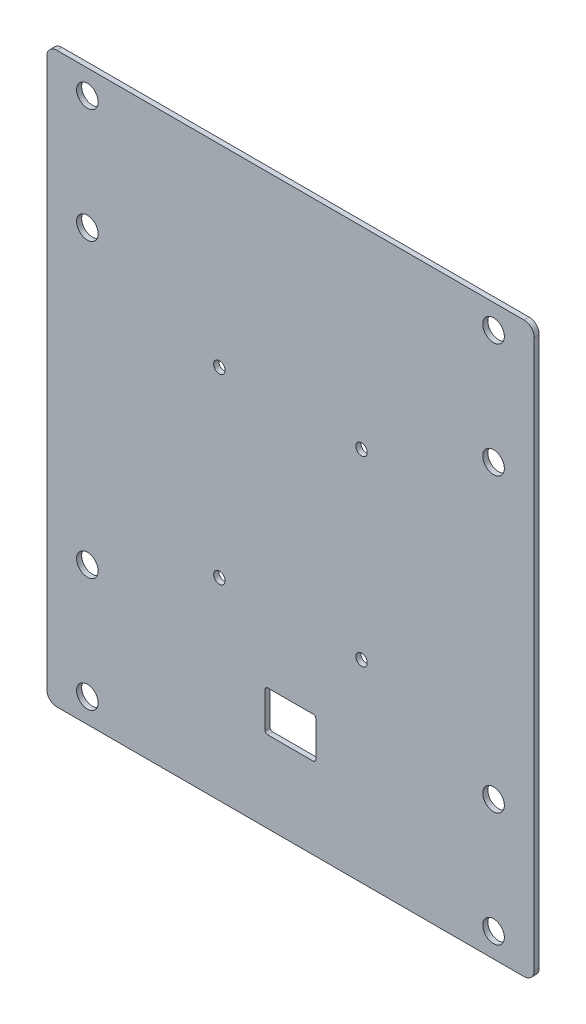
ISO-10303-21;
HEADER;
FILE_DESCRIPTION(('STEP AP214'),'2;1');
FILE_NAME('part.step','',(''),(''),'','','');
FILE_SCHEMA(('AUTOMOTIVE_DESIGN { 1 0 10303 214 1 1 1 1 }'));
ENDSEC;
DATA;
#1=APPLICATION_CONTEXT('core data for automotive mechanical design processes');
#2=APPLICATION_PROTOCOL_DEFINITION('international standard','automotive_design',2000,#1);
#3=PRODUCT_CONTEXT('',#1,'mechanical');
#4=PRODUCT('Part','Part','',(#3));
#5=PRODUCT_RELATED_PRODUCT_CATEGORY('part','',(#4));
#6=PRODUCT_DEFINITION_FORMATION('','',#4);
#7=PRODUCT_DEFINITION_CONTEXT('part definition',#1,'design');
#8=PRODUCT_DEFINITION('design','',#6,#7);
#9=PRODUCT_DEFINITION_SHAPE('','',#8);
#10=(LENGTH_UNIT() NAMED_UNIT(*) SI_UNIT(.MILLI.,.METRE.));
#11=(NAMED_UNIT(*) PLANE_ANGLE_UNIT() SI_UNIT($,.RADIAN.));
#12=(NAMED_UNIT(*) SI_UNIT($,.STERADIAN.) SOLID_ANGLE_UNIT());
#13=UNCERTAINTY_MEASURE_WITH_UNIT(LENGTH_MEASURE(1.E-05),#10,'distance_accuracy_value','');
#14=(GEOMETRIC_REPRESENTATION_CONTEXT(3) GLOBAL_UNCERTAINTY_ASSIGNED_CONTEXT((#13)) GLOBAL_UNIT_ASSIGNED_CONTEXT((#10,
#11,#12)) REPRESENTATION_CONTEXT('',''));
#15=CARTESIAN_POINT('',(0.,0.,0.));
#16=DIRECTION('',(0.,0.,1.));
#17=DIRECTION('',(1.,0.,0.));
#18=AXIS2_PLACEMENT_3D('',#15,#16,#17);
#19=CARTESIAN_POINT('',(152.4,177.8,3.175));
#20=DIRECTION('',(-1.,0.,0.));
#21=DIRECTION('',(0.,-1.,0.));
#22=AXIS2_PLACEMENT_3D('',#19,#20,#21);
#23=PLANE('',#22);
#24=DIRECTION('',(0.,1.,0.));
#25=VECTOR('',#24,1.);
#26=CARTESIAN_POINT('',(152.4,177.8,3.175));
#27=LINE('',#26,#25);
#28=CARTESIAN_POINT('',(152.4,-171.45,3.175));
#29=VERTEX_POINT('',#28);
#30=CARTESIAN_POINT('',(152.4,171.45,3.175));
#31=VERTEX_POINT('',#30);
#32=EDGE_CURVE('E164',#29,#31,#27,.T.);
#33=ORIENTED_EDGE('',*,*,#32,.F.);
#34=DIRECTION('',(0.,0.,-1.));
#35=VECTOR('',#34,1.);
#36=CARTESIAN_POINT('',(152.4,-171.45,3.175));
#37=LINE('',#36,#35);
#38=CARTESIAN_POINT('',(152.4,-171.45,0.));
#39=VERTEX_POINT('',#38);
#40=EDGE_CURVE('E149',#29,#39,#37,.T.);
#41=ORIENTED_EDGE('',*,*,#40,.T.);
#42=DIRECTION('',(0.,1.,0.));
#43=VECTOR('',#42,1.);
#44=CARTESIAN_POINT('',(152.4,177.8,0.));
#45=LINE('',#44,#43);
#46=CARTESIAN_POINT('',(152.4,171.45,0.));
#47=VERTEX_POINT('',#46);
#48=EDGE_CURVE('E161',#39,#47,#45,.T.);
#49=ORIENTED_EDGE('',*,*,#48,.T.);
#50=DIRECTION('',(0.,0.,-1.));
#51=VECTOR('',#50,1.);
#52=CARTESIAN_POINT('',(152.4,171.45,3.175));
#53=LINE('',#52,#51);
#54=EDGE_CURVE('E166',#47,#31,#53,.F.);
#55=ORIENTED_EDGE('',*,*,#54,.T.);
#56=EDGE_LOOP('',(#33,#41,#49,#55));
#57=FACE_BOUND('',#56,.T.);
#58=ADVANCED_FACE('F32',(#57),#23,.F.);
#59=CARTESIAN_POINT('',(-152.4,177.8,3.175));
#60=DIRECTION('',(0.,-1.,0.));
#61=DIRECTION('',(0.,0.,-1.));
#62=AXIS2_PLACEMENT_3D('',#59,#60,#61);
#63=PLANE('',#62);
#64=DIRECTION('',(-1.,0.,0.));
#65=VECTOR('',#64,1.);
#66=CARTESIAN_POINT('',(-152.4,177.8,3.175));
#67=LINE('',#66,#65);
#68=CARTESIAN_POINT('',(146.05,177.8,3.175));
#69=VERTEX_POINT('',#68);
#70=CARTESIAN_POINT('',(-146.05,177.8,3.175));
#71=VERTEX_POINT('',#70);
#72=EDGE_CURVE('E348',#69,#71,#67,.T.);
#73=ORIENTED_EDGE('',*,*,#72,.F.);
#74=DIRECTION('',(0.,0.,-1.));
#75=VECTOR('',#74,1.);
#76=CARTESIAN_POINT('',(146.05,177.8,3.175));
#77=LINE('',#76,#75);
#78=CARTESIAN_POINT('',(146.05,177.8,0.));
#79=VERTEX_POINT('',#78);
#80=EDGE_CURVE('E210',#69,#79,#77,.T.);
#81=ORIENTED_EDGE('',*,*,#80,.T.);
#82=DIRECTION('',(-1.,0.,0.));
#83=VECTOR('',#82,1.);
#84=CARTESIAN_POINT('',(-152.4,177.8,0.));
#85=LINE('',#84,#83);
#86=CARTESIAN_POINT('',(-146.05,177.8,0.));
#87=VERTEX_POINT('',#86);
#88=EDGE_CURVE('E171',#79,#87,#85,.T.);
#89=ORIENTED_EDGE('',*,*,#88,.T.);
#90=DIRECTION('',(0.,0.,-1.));
#91=VECTOR('',#90,1.);
#92=CARTESIAN_POINT('',(-146.05,177.8,3.175));
#93=LINE('',#92,#91);
#94=EDGE_CURVE('E208',#87,#71,#93,.F.);
#95=ORIENTED_EDGE('',*,*,#94,.T.);
#96=EDGE_LOOP('',(#73,#81,#89,#95));
#97=FACE_BOUND('',#96,.T.);
#98=ADVANCED_FACE('F373',(#97),#63,.F.);
#99=CARTESIAN_POINT('',(-152.4,177.8,3.175));
#100=DIRECTION('',(1.,0.,0.));
#101=DIRECTION('',(0.,1.,0.));
#102=AXIS2_PLACEMENT_3D('',#99,#100,#101);
#103=PLANE('',#102);
#104=DIRECTION('',(0.,-1.,0.));
#105=VECTOR('',#104,1.);
#106=CARTESIAN_POINT('',(-152.4,177.8,0.));
#107=LINE('',#106,#105);
#108=CARTESIAN_POINT('',(-152.4,171.45,0.));
#109=VERTEX_POINT('',#108);
#110=CARTESIAN_POINT('',(-152.4,-171.45,0.));
#111=VERTEX_POINT('',#110);
#112=EDGE_CURVE('E175',#109,#111,#107,.T.);
#113=ORIENTED_EDGE('',*,*,#112,.T.);
#114=DIRECTION('',(0.,0.,-1.));
#115=VECTOR('',#114,1.);
#116=CARTESIAN_POINT('',(-152.4,-171.45,3.175));
#117=LINE('',#116,#115);
#118=CARTESIAN_POINT('',(-152.4,-171.45,3.175));
#119=VERTEX_POINT('',#118);
#120=EDGE_CURVE('E206',#111,#119,#117,.F.);
#121=ORIENTED_EDGE('',*,*,#120,.T.);
#122=DIRECTION('',(0.,-1.,0.));
#123=VECTOR('',#122,1.);
#124=CARTESIAN_POINT('',(-152.4,177.8,3.175));
#125=LINE('',#124,#123);
#126=CARTESIAN_POINT('',(-152.4,171.45,3.175));
#127=VERTEX_POINT('',#126);
#128=EDGE_CURVE('E350',#127,#119,#125,.T.);
#129=ORIENTED_EDGE('',*,*,#128,.F.);
#130=DIRECTION('',(0.,0.,-1.));
#131=VECTOR('',#130,1.);
#132=CARTESIAN_POINT('',(-152.4,171.45,3.175));
#133=LINE('',#132,#131);
#134=EDGE_CURVE('E203',#127,#109,#133,.T.);
#135=ORIENTED_EDGE('',*,*,#134,.T.);
#136=EDGE_LOOP('',(#113,#121,#129,#135));
#137=FACE_BOUND('',#136,.T.);
#138=ADVANCED_FACE('F365',(#137),#103,.F.);
#139=CARTESIAN_POINT('',(-152.4,-177.8,3.175));
#140=DIRECTION('',(0.,1.,0.));
#141=DIRECTION('',(0.,0.,1.));
#142=AXIS2_PLACEMENT_3D('',#139,#140,#141);
#143=PLANE('',#142);
#144=DIRECTION('',(1.,0.,0.));
#145=VECTOR('',#144,1.);
#146=CARTESIAN_POINT('',(-152.4,-177.8,0.));
#147=LINE('',#146,#145);
#148=CARTESIAN_POINT('',(-146.05,-177.8,0.));
#149=VERTEX_POINT('',#148);
#150=CARTESIAN_POINT('',(146.05,-177.8,0.));
#151=VERTEX_POINT('',#150);
#152=EDGE_CURVE('E186',#149,#151,#147,.T.);
#153=ORIENTED_EDGE('',*,*,#152,.T.);
#154=DIRECTION('',(0.,0.,-1.));
#155=VECTOR('',#154,1.);
#156=CARTESIAN_POINT('',(146.05,-177.8,3.175));
#157=LINE('',#156,#155);
#158=CARTESIAN_POINT('',(146.05,-177.8,3.175));
#159=VERTEX_POINT('',#158);
#160=EDGE_CURVE('E150',#151,#159,#157,.F.);
#161=ORIENTED_EDGE('',*,*,#160,.T.);
#162=DIRECTION('',(1.,0.,0.));
#163=VECTOR('',#162,1.);
#164=CARTESIAN_POINT('',(-152.4,-177.8,3.175));
#165=LINE('',#164,#163);
#166=CARTESIAN_POINT('',(-146.05,-177.8,3.175));
#167=VERTEX_POINT('',#166);
#168=EDGE_CURVE('E181',#167,#159,#165,.T.);
#169=ORIENTED_EDGE('',*,*,#168,.F.);
#170=DIRECTION('',(0.,0.,-1.));
#171=VECTOR('',#170,1.);
#172=CARTESIAN_POINT('',(-146.05,-177.8,3.175));
#173=LINE('',#172,#171);
#174=EDGE_CURVE('E155',#167,#149,#173,.T.);
#175=ORIENTED_EDGE('',*,*,#174,.T.);
#176=EDGE_LOOP('',(#153,#161,#169,#175));
#177=FACE_BOUND('',#176,.T.);
#178=ADVANCED_FACE('F359',(#177),#143,.F.);
#179=CARTESIAN_POINT('',(0.,0.,3.175));
#180=DIRECTION('',(0.,0.,1.));
#181=DIRECTION('',(1.,0.,0.));
#182=AXIS2_PLACEMENT_3D('',#179,#180,#181);
#183=PLANE('',#182);
#184=DIRECTION('',(-1.,0.,0.));
#185=VECTOR('',#184,1.);
#186=CARTESIAN_POINT('',(0.,-101.6,3.175));
#187=LINE('',#186,#185);
#188=CARTESIAN_POINT('',(14.2875,-101.6,3.175));
#189=VERTEX_POINT('',#188);
#190=CARTESIAN_POINT('',(-14.2875,-101.6,3.175));
#191=VERTEX_POINT('',#190);
#192=EDGE_CURVE('E250',#189,#191,#187,.T.);
#193=ORIENTED_EDGE('',*,*,#192,.F.);
#194=CARTESIAN_POINT('',(14.2875,-103.1875,3.175));
#195=DIRECTION('',(0.,0.,1.));
#196=DIRECTION('',(1.,0.,0.));
#197=AXIS2_PLACEMENT_3D('',#194,#195,#196);
#198=CIRCLE('',#197,1.5875);
#199=CARTESIAN_POINT('',(15.875,-103.1875,3.175));
#200=VERTEX_POINT('',#199);
#201=EDGE_CURVE('E40',#189,#200,#198,.F.);
#202=ORIENTED_EDGE('',*,*,#201,.T.);
#203=DIRECTION('',(0.,-1.,0.));
#204=VECTOR('',#203,1.);
#205=CARTESIAN_POINT('',(15.8750000000001,0.,3.175));
#206=LINE('',#205,#204);
#207=CARTESIAN_POINT('',(15.875,-125.4125,3.175));
#208=VERTEX_POINT('',#207);
#209=EDGE_CURVE('E249',#200,#208,#206,.T.);
#210=ORIENTED_EDGE('',*,*,#209,.T.);
#211=CARTESIAN_POINT('',(14.2875,-125.4125,3.175));
#212=DIRECTION('',(0.,0.,1.));
#213=DIRECTION('',(1.,0.,0.));
#214=AXIS2_PLACEMENT_3D('',#211,#212,#213);
#215=CIRCLE('',#214,1.5875);
#216=CARTESIAN_POINT('',(14.2875,-127.,3.175));
#217=VERTEX_POINT('',#216);
#218=EDGE_CURVE('E232',#208,#217,#215,.F.);
#219=ORIENTED_EDGE('',*,*,#218,.T.);
#220=DIRECTION('',(-1.,0.,0.));
#221=VECTOR('',#220,1.);
#222=CARTESIAN_POINT('',(0.,-127.,3.175));
#223=LINE('',#222,#221);
#224=CARTESIAN_POINT('',(-14.2875,-127.,3.175));
#225=VERTEX_POINT('',#224);
#226=EDGE_CURVE('E259',#217,#225,#223,.T.);
#227=ORIENTED_EDGE('',*,*,#226,.T.);
#228=CARTESIAN_POINT('',(-14.2875,-125.4125,3.175));
#229=DIRECTION('',(0.,0.,1.));
#230=DIRECTION('',(1.,0.,0.));
#231=AXIS2_PLACEMENT_3D('',#228,#229,#230);
#232=CIRCLE('',#231,1.5875);
#233=CARTESIAN_POINT('',(-15.875,-125.4125,3.175));
#234=VERTEX_POINT('',#233);
#235=EDGE_CURVE('E236',#225,#234,#232,.F.);
#236=ORIENTED_EDGE('',*,*,#235,.T.);
#237=DIRECTION('',(0.,-1.,0.));
#238=VECTOR('',#237,1.);
#239=CARTESIAN_POINT('',(-15.875,0.,3.175));
#240=LINE('',#239,#238);
#241=CARTESIAN_POINT('',(-15.875,-103.1875,3.175));
#242=VERTEX_POINT('',#241);
#243=EDGE_CURVE('E275',#242,#234,#240,.T.);
#244=ORIENTED_EDGE('',*,*,#243,.F.);
#245=CARTESIAN_POINT('',(-14.2875,-103.1875,3.175));
#246=DIRECTION('',(0.,0.,1.));
#247=DIRECTION('',(1.,0.,0.));
#248=AXIS2_PLACEMENT_3D('',#245,#246,#247);
#249=CIRCLE('',#248,1.5875);
#250=EDGE_CURVE('E240',#242,#191,#249,.F.);
#251=ORIENTED_EDGE('',*,*,#250,.T.);
#252=EDGE_LOOP('',(#193,#202,#210,#219,#227,#236,#244,#251));
#253=FACE_BOUND('',#252,.T.);
#254=CARTESIAN_POINT('',(44.4499999999999,56.9515624999999,3.175));
#255=DIRECTION('',(0.,0.,-1.));
#256=DIRECTION('',(-1.,0.,0.));
#257=AXIS2_PLACEMENT_3D('',#254,#255,#256);
#258=CIRCLE('',#257,3.57124);
#259=CARTESIAN_POINT('',(40.8787599999999,56.9515624999999,3.175));
#260=VERTEX_POINT('',#259);
#261=EDGE_CURVE('E282',#260,#260,#258,.T.);
#262=ORIENTED_EDGE('',*,*,#261,.T.);
#263=EDGE_LOOP('',(#262));
#264=FACE_BOUND('',#263,.T.);
#265=CARTESIAN_POINT('',(44.4499999999999,-56.9515624999999,3.175));
#266=DIRECTION('',(0.,0.,-1.));
#267=DIRECTION('',(-1.,0.,0.));
#268=AXIS2_PLACEMENT_3D('',#265,#266,#267);
#269=CIRCLE('',#268,3.57124);
#270=CARTESIAN_POINT('',(40.8787599999999,-56.9515624999999,3.175));
#271=VERTEX_POINT('',#270);
#272=EDGE_CURVE('E288',#271,#271,#269,.T.);
#273=ORIENTED_EDGE('',*,*,#272,.T.);
#274=EDGE_LOOP('',(#273));
#275=FACE_BOUND('',#274,.T.);
#276=CARTESIAN_POINT('',(-44.4500000000001,56.9515624999999,3.175));
#277=DIRECTION('',(0.,0.,-1.));
#278=DIRECTION('',(-1.,0.,0.));
#279=AXIS2_PLACEMENT_3D('',#276,#277,#278);
#280=CIRCLE('',#279,3.57124);
#281=CARTESIAN_POINT('',(-48.0212400000001,56.9515624999999,3.175));
#282=VERTEX_POINT('',#281);
#283=EDGE_CURVE('E294',#282,#282,#280,.T.);
#284=ORIENTED_EDGE('',*,*,#283,.T.);
#285=EDGE_LOOP('',(#284));
#286=FACE_BOUND('',#285,.T.);
#287=CARTESIAN_POINT('',(-44.4500000000001,-56.9515624999999,3.175));
#288=DIRECTION('',(0.,0.,-1.));
#289=DIRECTION('',(-1.,0.,0.));
#290=AXIS2_PLACEMENT_3D('',#287,#288,#289);
#291=CIRCLE('',#290,3.57124);
#292=CARTESIAN_POINT('',(-48.0212400000001,-56.9515624999999,3.175));
#293=VERTEX_POINT('',#292);
#294=EDGE_CURVE('E300',#293,#293,#291,.T.);
#295=ORIENTED_EDGE('',*,*,#294,.T.);
#296=EDGE_LOOP('',(#295));
#297=FACE_BOUND('',#296,.T.);
#298=CARTESIAN_POINT('',(-127.,162.71875,3.175));
#299=DIRECTION('',(0.,0.,1.));
#300=DIRECTION('',(1.,0.,0.));
#301=AXIS2_PLACEMENT_3D('',#298,#299,#300);
#302=CIRCLE('',#301,6.746875);
#303=CARTESIAN_POINT('',(-120.253125,162.71875,3.175));
#304=VERTEX_POINT('',#303);
#305=EDGE_CURVE('E303',#304,#304,#302,.T.);
#306=ORIENTED_EDGE('',*,*,#305,.F.);
#307=EDGE_LOOP('',(#306));
#308=FACE_BOUND('',#307,.T.);
#309=CARTESIAN_POINT('',(-127.,91.2812499999997,3.175));
#310=DIRECTION('',(0.,0.,1.));
#311=DIRECTION('',(1.,0.,0.));
#312=AXIS2_PLACEMENT_3D('',#309,#310,#311);
#313=CIRCLE('',#312,6.746875);
#314=CARTESIAN_POINT('',(-120.253125,91.2812499999997,3.175));
#315=VERTEX_POINT('',#314);
#316=EDGE_CURVE('E309',#315,#315,#313,.T.);
#317=ORIENTED_EDGE('',*,*,#316,.F.);
#318=EDGE_LOOP('',(#317));
#319=FACE_BOUND('',#318,.T.);
#320=CARTESIAN_POINT('',(-127.,-91.2812500000001,3.175));
#321=DIRECTION('',(0.,0.,1.));
#322=DIRECTION('',(1.,0.,0.));
#323=AXIS2_PLACEMENT_3D('',#320,#321,#322);
#324=CIRCLE('',#323,6.746875);
#325=CARTESIAN_POINT('',(-120.253125,-91.2812500000001,3.175));
#326=VERTEX_POINT('',#325);
#327=EDGE_CURVE('E315',#326,#326,#324,.T.);
#328=ORIENTED_EDGE('',*,*,#327,.F.);
#329=EDGE_LOOP('',(#328));
#330=FACE_BOUND('',#329,.T.);
#331=CARTESIAN_POINT('',(-127.,-162.71875,3.175));
#332=DIRECTION('',(0.,0.,1.));
#333=DIRECTION('',(1.,0.,0.));
#334=AXIS2_PLACEMENT_3D('',#331,#332,#333);
#335=CIRCLE('',#334,6.746875);
#336=CARTESIAN_POINT('',(-120.253125,-162.71875,3.175));
#337=VERTEX_POINT('',#336);
#338=EDGE_CURVE('E321',#337,#337,#335,.T.);
#339=ORIENTED_EDGE('',*,*,#338,.F.);
#340=EDGE_LOOP('',(#339));
#341=FACE_BOUND('',#340,.T.);
#342=CARTESIAN_POINT('',(127.,-162.71875,3.175));
#343=DIRECTION('',(0.,0.,1.));
#344=DIRECTION('',(1.,0.,0.));
#345=AXIS2_PLACEMENT_3D('',#342,#343,#344);
#346=CIRCLE('',#345,6.74687500000001);
#347=CARTESIAN_POINT('',(133.746875,-162.71875,3.175));
#348=VERTEX_POINT('',#347);
#349=EDGE_CURVE('E327',#348,#348,#346,.T.);
#350=ORIENTED_EDGE('',*,*,#349,.F.);
#351=EDGE_LOOP('',(#350));
#352=FACE_BOUND('',#351,.T.);
#353=CARTESIAN_POINT('',(127.,-91.28125,3.175));
#354=DIRECTION('',(0.,0.,1.));
#355=DIRECTION('',(1.,0.,0.));
#356=AXIS2_PLACEMENT_3D('',#353,#354,#355);
#357=CIRCLE('',#356,6.74687499999999);
#358=CARTESIAN_POINT('',(133.746875,-91.28125,3.175));
#359=VERTEX_POINT('',#358);
#360=EDGE_CURVE('E333',#359,#359,#357,.T.);
#361=ORIENTED_EDGE('',*,*,#360,.F.);
#362=EDGE_LOOP('',(#361));
#363=FACE_BOUND('',#362,.T.);
#364=CARTESIAN_POINT('',(127.,91.2812499999998,3.175));
#365=DIRECTION('',(0.,0.,1.));
#366=DIRECTION('',(1.,0.,0.));
#367=AXIS2_PLACEMENT_3D('',#364,#365,#366);
#368=CIRCLE('',#367,6.74687499999999);
#369=CARTESIAN_POINT('',(133.746875,91.2812499999998,3.175));
#370=VERTEX_POINT('',#369);
#371=EDGE_CURVE('E339',#370,#370,#368,.T.);
#372=ORIENTED_EDGE('',*,*,#371,.F.);
#373=EDGE_LOOP('',(#372));
#374=FACE_BOUND('',#373,.T.);
#375=CARTESIAN_POINT('',(127.,162.71875,3.175));
#376=DIRECTION('',(0.,0.,1.));
#377=DIRECTION('',(1.,0.,0.));
#378=AXIS2_PLACEMENT_3D('',#375,#376,#377);
#379=CIRCLE('',#378,6.74687499999999);
#380=CARTESIAN_POINT('',(133.746875,162.71875,3.175));
#381=VERTEX_POINT('',#380);
#382=EDGE_CURVE('E178',#381,#381,#379,.T.);
#383=ORIENTED_EDGE('',*,*,#382,.F.);
#384=EDGE_LOOP('',(#383));
#385=FACE_BOUND('',#384,.T.);
#386=ORIENTED_EDGE('',*,*,#168,.T.);
#387=CARTESIAN_POINT('',(146.05,-171.45,3.175));
#388=DIRECTION('',(0.,0.,1.));
#389=DIRECTION('',(1.,0.,0.));
#390=AXIS2_PLACEMENT_3D('',#387,#388,#389);
#391=CIRCLE('',#390,6.35);
#392=EDGE_CURVE('E201',#159,#29,#391,.T.);
#393=ORIENTED_EDGE('',*,*,#392,.T.);
#394=ORIENTED_EDGE('',*,*,#32,.T.);
#395=CARTESIAN_POINT('',(146.05,171.45,3.175));
#396=DIRECTION('',(0.,0.,1.));
#397=DIRECTION('',(1.,0.,0.));
#398=AXIS2_PLACEMENT_3D('',#395,#396,#397);
#399=CIRCLE('',#398,6.35);
#400=EDGE_CURVE('E197',#31,#69,#399,.T.);
#401=ORIENTED_EDGE('',*,*,#400,.T.);
#402=ORIENTED_EDGE('',*,*,#72,.T.);
#403=CARTESIAN_POINT('',(-146.05,171.45,3.175));
#404=DIRECTION('',(0.,0.,1.));
#405=DIRECTION('',(1.,0.,0.));
#406=AXIS2_PLACEMENT_3D('',#403,#404,#405);
#407=CIRCLE('',#406,6.35);
#408=EDGE_CURVE('E195',#71,#127,#407,.T.);
#409=ORIENTED_EDGE('',*,*,#408,.T.);
#410=ORIENTED_EDGE('',*,*,#128,.T.);
#411=CARTESIAN_POINT('',(-146.05,-171.45,3.175));
#412=DIRECTION('',(0.,0.,1.));
#413=DIRECTION('',(1.,0.,0.));
#414=AXIS2_PLACEMENT_3D('',#411,#412,#413);
#415=CIRCLE('',#414,6.35);
#416=EDGE_CURVE('E199',#119,#167,#415,.T.);
#417=ORIENTED_EDGE('',*,*,#416,.T.);
#418=EDGE_LOOP('',(#386,#393,#394,#401,#402,#409,#410,#417));
#419=FACE_BOUND('',#418,.T.);
#420=ADVANCED_FACE('F247',(#253,#264,#275,#286,#297,#308,#319,#330,#341,#352,#363,#374,#385,
#419),#183,.T.);
#421=CARTESIAN_POINT('',(0.,0.,0.));
#422=DIRECTION('',(0.,0.,1.));
#423=DIRECTION('',(1.,0.,0.));
#424=AXIS2_PLACEMENT_3D('',#421,#422,#423);
#425=PLANE('',#424);
#426=DIRECTION('',(0.,-1.,0.));
#427=VECTOR('',#426,1.);
#428=CARTESIAN_POINT('',(15.8750000000001,0.,0.));
#429=LINE('',#428,#427);
#430=CARTESIAN_POINT('',(15.875,-103.1875,0.));
#431=VERTEX_POINT('',#430);
#432=CARTESIAN_POINT('',(15.875,-125.4125,0.));
#433=VERTEX_POINT('',#432);
#434=EDGE_CURVE('E271',#431,#433,#429,.T.);
#435=ORIENTED_EDGE('',*,*,#434,.F.);
#436=CARTESIAN_POINT('',(14.2875,-103.1875,0.));
#437=DIRECTION('',(0.,0.,1.));
#438=DIRECTION('',(1.,0.,0.));
#439=AXIS2_PLACEMENT_3D('',#436,#437,#438);
#440=CIRCLE('',#439,1.5875);
#441=CARTESIAN_POINT('',(14.2875,-101.6,0.));
#442=VERTEX_POINT('',#441);
#443=EDGE_CURVE('E11',#431,#442,#440,.T.);
#444=ORIENTED_EDGE('',*,*,#443,.T.);
#445=DIRECTION('',(-1.,0.,0.));
#446=VECTOR('',#445,1.);
#447=CARTESIAN_POINT('',(0.,-101.6,0.));
#448=LINE('',#447,#446);
#449=CARTESIAN_POINT('',(-14.2875,-101.6,0.));
#450=VERTEX_POINT('',#449);
#451=EDGE_CURVE('E258',#442,#450,#448,.T.);
#452=ORIENTED_EDGE('',*,*,#451,.T.);
#453=CARTESIAN_POINT('',(-14.2875,-103.1875,0.));
#454=DIRECTION('',(0.,0.,1.));
#455=DIRECTION('',(1.,0.,0.));
#456=AXIS2_PLACEMENT_3D('',#453,#454,#455);
#457=CIRCLE('',#456,1.5875);
#458=CARTESIAN_POINT('',(-15.875,-103.1875,0.));
#459=VERTEX_POINT('',#458);
#460=EDGE_CURVE('E242',#450,#459,#457,.T.);
#461=ORIENTED_EDGE('',*,*,#460,.T.);
#462=DIRECTION('',(0.,-1.,0.));
#463=VECTOR('',#462,1.);
#464=CARTESIAN_POINT('',(-15.875,0.,0.));
#465=LINE('',#464,#463);
#466=CARTESIAN_POINT('',(-15.875,-125.4125,0.));
#467=VERTEX_POINT('',#466);
#468=EDGE_CURVE('E263',#459,#467,#465,.T.);
#469=ORIENTED_EDGE('',*,*,#468,.T.);
#470=CARTESIAN_POINT('',(-14.2875,-125.4125,0.));
#471=DIRECTION('',(0.,0.,1.));
#472=DIRECTION('',(1.,0.,0.));
#473=AXIS2_PLACEMENT_3D('',#470,#471,#472);
#474=CIRCLE('',#473,1.5875);
#475=CARTESIAN_POINT('',(-14.2875,-127.,0.));
#476=VERTEX_POINT('',#475);
#477=EDGE_CURVE('E238',#467,#476,#474,.T.);
#478=ORIENTED_EDGE('',*,*,#477,.T.);
#479=DIRECTION('',(-1.,0.,0.));
#480=VECTOR('',#479,1.);
#481=CARTESIAN_POINT('',(0.,-127.,0.));
#482=LINE('',#481,#480);
#483=CARTESIAN_POINT('',(14.2875,-127.,0.));
#484=VERTEX_POINT('',#483);
#485=EDGE_CURVE('E266',#484,#476,#482,.T.);
#486=ORIENTED_EDGE('',*,*,#485,.F.);
#487=CARTESIAN_POINT('',(14.2875,-125.4125,0.));
#488=DIRECTION('',(0.,0.,1.));
#489=DIRECTION('',(1.,0.,0.));
#490=AXIS2_PLACEMENT_3D('',#487,#488,#489);
#491=CIRCLE('',#490,1.5875);
#492=EDGE_CURVE('E234',#484,#433,#491,.T.);
#493=ORIENTED_EDGE('',*,*,#492,.T.);
#494=EDGE_LOOP('',(#435,#444,#452,#461,#469,#478,#486,#493));
#495=FACE_BOUND('',#494,.T.);
#496=CARTESIAN_POINT('',(44.4499999999999,56.9515624999999,0.));
#497=DIRECTION('',(0.,0.,-1.));
#498=DIRECTION('',(-1.,0.,0.));
#499=AXIS2_PLACEMENT_3D('',#496,#497,#498);
#500=CIRCLE('',#499,3.57124);
#501=CARTESIAN_POINT('',(40.8787599999999,56.9515624999999,0.));
#502=VERTEX_POINT('',#501);
#503=EDGE_CURVE('E273',#502,#502,#500,.T.);
#504=ORIENTED_EDGE('',*,*,#503,.F.);
#505=EDGE_LOOP('',(#504));
#506=FACE_BOUND('',#505,.T.);
#507=CARTESIAN_POINT('',(44.4499999999999,-56.9515624999999,0.));
#508=DIRECTION('',(0.,0.,-1.));
#509=DIRECTION('',(-1.,0.,0.));
#510=AXIS2_PLACEMENT_3D('',#507,#508,#509);
#511=CIRCLE('',#510,3.57124);
#512=CARTESIAN_POINT('',(40.8787599999999,-56.9515624999999,0.));
#513=VERTEX_POINT('',#512);
#514=EDGE_CURVE('E285',#513,#513,#511,.T.);
#515=ORIENTED_EDGE('',*,*,#514,.F.);
#516=EDGE_LOOP('',(#515));
#517=FACE_BOUND('',#516,.T.);
#518=CARTESIAN_POINT('',(-44.4500000000001,56.9515624999999,0.));
#519=DIRECTION('',(0.,0.,-1.));
#520=DIRECTION('',(-1.,0.,0.));
#521=AXIS2_PLACEMENT_3D('',#518,#519,#520);
#522=CIRCLE('',#521,3.57124);
#523=CARTESIAN_POINT('',(-48.0212400000001,56.9515624999999,0.));
#524=VERTEX_POINT('',#523);
#525=EDGE_CURVE('E291',#524,#524,#522,.T.);
#526=ORIENTED_EDGE('',*,*,#525,.F.);
#527=EDGE_LOOP('',(#526));
#528=FACE_BOUND('',#527,.T.);
#529=CARTESIAN_POINT('',(-44.4500000000001,-56.9515624999999,0.));
#530=DIRECTION('',(0.,0.,-1.));
#531=DIRECTION('',(-1.,0.,0.));
#532=AXIS2_PLACEMENT_3D('',#529,#530,#531);
#533=CIRCLE('',#532,3.57124);
#534=CARTESIAN_POINT('',(-48.0212400000001,-56.9515624999999,0.));
#535=VERTEX_POINT('',#534);
#536=EDGE_CURVE('E297',#535,#535,#533,.T.);
#537=ORIENTED_EDGE('',*,*,#536,.F.);
#538=EDGE_LOOP('',(#537));
#539=FACE_BOUND('',#538,.T.);
#540=CARTESIAN_POINT('',(-127.,162.71875,0.));
#541=DIRECTION('',(0.,0.,1.));
#542=DIRECTION('',(1.,0.,0.));
#543=AXIS2_PLACEMENT_3D('',#540,#541,#542);
#544=CIRCLE('',#543,6.746875);
#545=CARTESIAN_POINT('',(-120.253125,162.71875,0.));
#546=VERTEX_POINT('',#545);
#547=EDGE_CURVE('E306',#546,#546,#544,.T.);
#548=ORIENTED_EDGE('',*,*,#547,.T.);
#549=EDGE_LOOP('',(#548));
#550=FACE_BOUND('',#549,.T.);
#551=CARTESIAN_POINT('',(-127.,91.2812499999997,0.));
#552=DIRECTION('',(0.,0.,1.));
#553=DIRECTION('',(1.,0.,0.));
#554=AXIS2_PLACEMENT_3D('',#551,#552,#553);
#555=CIRCLE('',#554,6.746875);
#556=CARTESIAN_POINT('',(-120.253125,91.2812499999997,0.));
#557=VERTEX_POINT('',#556);
#558=EDGE_CURVE('E312',#557,#557,#555,.T.);
#559=ORIENTED_EDGE('',*,*,#558,.T.);
#560=EDGE_LOOP('',(#559));
#561=FACE_BOUND('',#560,.T.);
#562=CARTESIAN_POINT('',(-127.,-91.2812500000001,0.));
#563=DIRECTION('',(0.,0.,1.));
#564=DIRECTION('',(1.,0.,0.));
#565=AXIS2_PLACEMENT_3D('',#562,#563,#564);
#566=CIRCLE('',#565,6.746875);
#567=CARTESIAN_POINT('',(-120.253125,-91.2812500000001,0.));
#568=VERTEX_POINT('',#567);
#569=EDGE_CURVE('E318',#568,#568,#566,.T.);
#570=ORIENTED_EDGE('',*,*,#569,.T.);
#571=EDGE_LOOP('',(#570));
#572=FACE_BOUND('',#571,.T.);
#573=CARTESIAN_POINT('',(-127.,-162.71875,0.));
#574=DIRECTION('',(0.,0.,1.));
#575=DIRECTION('',(1.,0.,0.));
#576=AXIS2_PLACEMENT_3D('',#573,#574,#575);
#577=CIRCLE('',#576,6.746875);
#578=CARTESIAN_POINT('',(-120.253125,-162.71875,0.));
#579=VERTEX_POINT('',#578);
#580=EDGE_CURVE('E324',#579,#579,#577,.T.);
#581=ORIENTED_EDGE('',*,*,#580,.T.);
#582=EDGE_LOOP('',(#581));
#583=FACE_BOUND('',#582,.T.);
#584=CARTESIAN_POINT('',(127.,-162.71875,0.));
#585=DIRECTION('',(0.,0.,1.));
#586=DIRECTION('',(1.,0.,0.));
#587=AXIS2_PLACEMENT_3D('',#584,#585,#586);
#588=CIRCLE('',#587,6.74687500000001);
#589=CARTESIAN_POINT('',(133.746875,-162.71875,0.));
#590=VERTEX_POINT('',#589);
#591=EDGE_CURVE('E330',#590,#590,#588,.T.);
#592=ORIENTED_EDGE('',*,*,#591,.T.);
#593=EDGE_LOOP('',(#592));
#594=FACE_BOUND('',#593,.T.);
#595=CARTESIAN_POINT('',(127.,-91.28125,0.));
#596=DIRECTION('',(0.,0.,1.));
#597=DIRECTION('',(1.,0.,0.));
#598=AXIS2_PLACEMENT_3D('',#595,#596,#597);
#599=CIRCLE('',#598,6.74687499999999);
#600=CARTESIAN_POINT('',(133.746875,-91.28125,0.));
#601=VERTEX_POINT('',#600);
#602=EDGE_CURVE('E336',#601,#601,#599,.T.);
#603=ORIENTED_EDGE('',*,*,#602,.T.);
#604=EDGE_LOOP('',(#603));
#605=FACE_BOUND('',#604,.T.);
#606=CARTESIAN_POINT('',(127.,91.2812499999998,0.));
#607=DIRECTION('',(0.,0.,1.));
#608=DIRECTION('',(1.,0.,0.));
#609=AXIS2_PLACEMENT_3D('',#606,#607,#608);
#610=CIRCLE('',#609,6.74687499999999);
#611=CARTESIAN_POINT('',(133.746875,91.2812499999998,0.));
#612=VERTEX_POINT('',#611);
#613=EDGE_CURVE('E342',#612,#612,#610,.T.);
#614=ORIENTED_EDGE('',*,*,#613,.T.);
#615=EDGE_LOOP('',(#614));
#616=FACE_BOUND('',#615,.T.);
#617=CARTESIAN_POINT('',(127.,162.71875,0.));
#618=DIRECTION('',(0.,0.,1.));
#619=DIRECTION('',(1.,0.,0.));
#620=AXIS2_PLACEMENT_3D('',#617,#618,#619);
#621=CIRCLE('',#620,6.74687499999999);
#622=CARTESIAN_POINT('',(133.746875,162.71875,0.));
#623=VERTEX_POINT('',#622);
#624=EDGE_CURVE('E172',#623,#623,#621,.T.);
#625=ORIENTED_EDGE('',*,*,#624,.T.);
#626=EDGE_LOOP('',(#625));
#627=FACE_BOUND('',#626,.T.);
#628=ORIENTED_EDGE('',*,*,#48,.F.);
#629=CARTESIAN_POINT('',(146.05,-171.45,0.));
#630=DIRECTION('',(0.,0.,1.));
#631=DIRECTION('',(1.,0.,0.));
#632=AXIS2_PLACEMENT_3D('',#629,#630,#631);
#633=CIRCLE('',#632,6.35);
#634=EDGE_CURVE('E145',#39,#151,#633,.F.);
#635=ORIENTED_EDGE('',*,*,#634,.T.);
#636=ORIENTED_EDGE('',*,*,#152,.F.);
#637=CARTESIAN_POINT('',(-146.05,-171.45,0.));
#638=DIRECTION('',(0.,0.,1.));
#639=DIRECTION('',(1.,0.,0.));
#640=AXIS2_PLACEMENT_3D('',#637,#638,#639);
#641=CIRCLE('',#640,6.35);
#642=EDGE_CURVE('E156',#149,#111,#641,.F.);
#643=ORIENTED_EDGE('',*,*,#642,.T.);
#644=ORIENTED_EDGE('',*,*,#112,.F.);
#645=CARTESIAN_POINT('',(-146.05,171.45,0.));
#646=DIRECTION('',(0.,0.,1.));
#647=DIRECTION('',(1.,0.,0.));
#648=AXIS2_PLACEMENT_3D('',#645,#646,#647);
#649=CIRCLE('',#648,6.35);
#650=EDGE_CURVE('E165',#109,#87,#649,.F.);
#651=ORIENTED_EDGE('',*,*,#650,.T.);
#652=ORIENTED_EDGE('',*,*,#88,.F.);
#653=CARTESIAN_POINT('',(146.05,171.45,0.));
#654=DIRECTION('',(0.,0.,1.));
#655=DIRECTION('',(1.,0.,0.));
#656=AXIS2_PLACEMENT_3D('',#653,#654,#655);
#657=CIRCLE('',#656,6.35);
#658=EDGE_CURVE('E170',#79,#47,#657,.F.);
#659=ORIENTED_EDGE('',*,*,#658,.T.);
#660=EDGE_LOOP('',(#628,#635,#636,#643,#644,#651,#652,#659));
#661=FACE_BOUND('',#660,.T.);
#662=ADVANCED_FACE('F168',(#495,#506,#517,#528,#539,#550,#561,#572,#583,#594,#605,#616,#627,
#661),#425,.F.);
#663=CARTESIAN_POINT('',(127.,162.71875,3.175));
#664=DIRECTION('',(0.,0.,1.));
#665=DIRECTION('',(1.,0.,0.));
#666=AXIS2_PLACEMENT_3D('',#663,#664,#665);
#667=CYLINDRICAL_SURFACE('',#666,6.74687499999999);
#668=ORIENTED_EDGE('',*,*,#624,.F.);
#669=EDGE_LOOP('',(#668));
#670=FACE_BOUND('',#669,.T.);
#671=ORIENTED_EDGE('',*,*,#382,.T.);
#672=EDGE_LOOP('',(#671));
#673=FACE_BOUND('',#672,.T.);
#674=ADVANCED_FACE('F432',(#670,#673),#667,.F.);
#675=CARTESIAN_POINT('',(127.,91.2812499999998,3.175));
#676=DIRECTION('',(0.,0.,1.));
#677=DIRECTION('',(1.,0.,0.));
#678=AXIS2_PLACEMENT_3D('',#675,#676,#677);
#679=CYLINDRICAL_SURFACE('',#678,6.74687499999999);
#680=ORIENTED_EDGE('',*,*,#613,.F.);
#681=EDGE_LOOP('',(#680));
#682=FACE_BOUND('',#681,.T.);
#683=ORIENTED_EDGE('',*,*,#371,.T.);
#684=EDGE_LOOP('',(#683));
#685=FACE_BOUND('',#684,.T.);
#686=ADVANCED_FACE('F428',(#682,#685),#679,.F.);
#687=CARTESIAN_POINT('',(127.,-91.28125,3.175));
#688=DIRECTION('',(0.,0.,1.));
#689=DIRECTION('',(1.,0.,0.));
#690=AXIS2_PLACEMENT_3D('',#687,#688,#689);
#691=CYLINDRICAL_SURFACE('',#690,6.74687499999999);
#692=ORIENTED_EDGE('',*,*,#602,.F.);
#693=EDGE_LOOP('',(#692));
#694=FACE_BOUND('',#693,.T.);
#695=ORIENTED_EDGE('',*,*,#360,.T.);
#696=EDGE_LOOP('',(#695));
#697=FACE_BOUND('',#696,.T.);
#698=ADVANCED_FACE('F424',(#694,#697),#691,.F.);
#699=CARTESIAN_POINT('',(127.,-162.71875,3.175));
#700=DIRECTION('',(0.,0.,1.));
#701=DIRECTION('',(1.,0.,0.));
#702=AXIS2_PLACEMENT_3D('',#699,#700,#701);
#703=CYLINDRICAL_SURFACE('',#702,6.74687500000001);
#704=ORIENTED_EDGE('',*,*,#591,.F.);
#705=EDGE_LOOP('',(#704));
#706=FACE_BOUND('',#705,.T.);
#707=ORIENTED_EDGE('',*,*,#349,.T.);
#708=EDGE_LOOP('',(#707));
#709=FACE_BOUND('',#708,.T.);
#710=ADVANCED_FACE('F420',(#706,#709),#703,.F.);
#711=CARTESIAN_POINT('',(-127.,-162.71875,3.175));
#712=DIRECTION('',(0.,0.,1.));
#713=DIRECTION('',(1.,0.,0.));
#714=AXIS2_PLACEMENT_3D('',#711,#712,#713);
#715=CYLINDRICAL_SURFACE('',#714,6.746875);
#716=ORIENTED_EDGE('',*,*,#580,.F.);
#717=EDGE_LOOP('',(#716));
#718=FACE_BOUND('',#717,.T.);
#719=ORIENTED_EDGE('',*,*,#338,.T.);
#720=EDGE_LOOP('',(#719));
#721=FACE_BOUND('',#720,.T.);
#722=ADVANCED_FACE('F416',(#718,#721),#715,.F.);
#723=CARTESIAN_POINT('',(-127.,-91.2812500000001,3.175));
#724=DIRECTION('',(0.,0.,1.));
#725=DIRECTION('',(1.,0.,0.));
#726=AXIS2_PLACEMENT_3D('',#723,#724,#725);
#727=CYLINDRICAL_SURFACE('',#726,6.746875);
#728=ORIENTED_EDGE('',*,*,#569,.F.);
#729=EDGE_LOOP('',(#728));
#730=FACE_BOUND('',#729,.T.);
#731=ORIENTED_EDGE('',*,*,#327,.T.);
#732=EDGE_LOOP('',(#731));
#733=FACE_BOUND('',#732,.T.);
#734=ADVANCED_FACE('F406',(#730,#733),#727,.F.);
#735=CARTESIAN_POINT('',(-127.,91.2812499999997,3.175));
#736=DIRECTION('',(0.,0.,1.));
#737=DIRECTION('',(1.,0.,0.));
#738=AXIS2_PLACEMENT_3D('',#735,#736,#737);
#739=CYLINDRICAL_SURFACE('',#738,6.746875);
#740=ORIENTED_EDGE('',*,*,#558,.F.);
#741=EDGE_LOOP('',(#740));
#742=FACE_BOUND('',#741,.T.);
#743=ORIENTED_EDGE('',*,*,#316,.T.);
#744=EDGE_LOOP('',(#743));
#745=FACE_BOUND('',#744,.T.);
#746=ADVANCED_FACE('F400',(#742,#745),#739,.F.);
#747=CARTESIAN_POINT('',(-127.,162.71875,3.175));
#748=DIRECTION('',(0.,0.,1.));
#749=DIRECTION('',(1.,0.,0.));
#750=AXIS2_PLACEMENT_3D('',#747,#748,#749);
#751=CYLINDRICAL_SURFACE('',#750,6.746875);
#752=ORIENTED_EDGE('',*,*,#547,.F.);
#753=EDGE_LOOP('',(#752));
#754=FACE_BOUND('',#753,.T.);
#755=ORIENTED_EDGE('',*,*,#305,.T.);
#756=EDGE_LOOP('',(#755));
#757=FACE_BOUND('',#756,.T.);
#758=ADVANCED_FACE('F396',(#754,#757),#751,.F.);
#759=CARTESIAN_POINT('',(146.05,-171.45,3.175));
#760=DIRECTION('',(0.,0.,-1.));
#761=DIRECTION('',(-1.,0.,0.));
#762=AXIS2_PLACEMENT_3D('',#759,#760,#761);
#763=CYLINDRICAL_SURFACE('',#762,6.35);
#764=ORIENTED_EDGE('',*,*,#392,.F.);
#765=ORIENTED_EDGE('',*,*,#160,.F.);
#766=ORIENTED_EDGE('',*,*,#634,.F.);
#767=ORIENTED_EDGE('',*,*,#40,.F.);
#768=EDGE_LOOP('',(#764,#765,#766,#767));
#769=FACE_BOUND('',#768,.T.);
#770=ADVANCED_FACE('F148',(#769),#763,.T.);
#771=CARTESIAN_POINT('',(-146.05,-171.45,3.175));
#772=DIRECTION('',(0.,0.,-1.));
#773=DIRECTION('',(-1.,0.,0.));
#774=AXIS2_PLACEMENT_3D('',#771,#772,#773);
#775=CYLINDRICAL_SURFACE('',#774,6.35);
#776=ORIENTED_EDGE('',*,*,#416,.F.);
#777=ORIENTED_EDGE('',*,*,#120,.F.);
#778=ORIENTED_EDGE('',*,*,#642,.F.);
#779=ORIENTED_EDGE('',*,*,#174,.F.);
#780=EDGE_LOOP('',(#776,#777,#778,#779));
#781=FACE_BOUND('',#780,.T.);
#782=ADVANCED_FACE('F361',(#781),#775,.T.);
#783=CARTESIAN_POINT('',(146.05,171.45,3.175));
#784=DIRECTION('',(0.,0.,-1.));
#785=DIRECTION('',(-1.,0.,0.));
#786=AXIS2_PLACEMENT_3D('',#783,#784,#785);
#787=CYLINDRICAL_SURFACE('',#786,6.35);
#788=ORIENTED_EDGE('',*,*,#400,.F.);
#789=ORIENTED_EDGE('',*,*,#54,.F.);
#790=ORIENTED_EDGE('',*,*,#658,.F.);
#791=ORIENTED_EDGE('',*,*,#80,.F.);
#792=EDGE_LOOP('',(#788,#789,#790,#791));
#793=FACE_BOUND('',#792,.T.);
#794=ADVANCED_FACE('F377',(#793),#787,.T.);
#795=CARTESIAN_POINT('',(-146.05,171.45,3.175));
#796=DIRECTION('',(0.,0.,-1.));
#797=DIRECTION('',(-1.,0.,0.));
#798=AXIS2_PLACEMENT_3D('',#795,#796,#797);
#799=CYLINDRICAL_SURFACE('',#798,6.35);
#800=ORIENTED_EDGE('',*,*,#408,.F.);
#801=ORIENTED_EDGE('',*,*,#94,.F.);
#802=ORIENTED_EDGE('',*,*,#650,.F.);
#803=ORIENTED_EDGE('',*,*,#134,.F.);
#804=EDGE_LOOP('',(#800,#801,#802,#803));
#805=FACE_BOUND('',#804,.T.);
#806=ADVANCED_FACE('F369',(#805),#799,.T.);
#807=CARTESIAN_POINT('',(-44.4500000000001,-56.9515624999999,0.));
#808=DIRECTION('',(0.,0.,-1.));
#809=DIRECTION('',(-1.,0.,0.));
#810=AXIS2_PLACEMENT_3D('',#807,#808,#809);
#811=CYLINDRICAL_SURFACE('',#810,3.57124);
#812=ORIENTED_EDGE('',*,*,#294,.F.);
#813=EDGE_LOOP('',(#812));
#814=FACE_BOUND('',#813,.T.);
#815=ORIENTED_EDGE('',*,*,#536,.T.);
#816=EDGE_LOOP('',(#815));
#817=FACE_BOUND('',#816,.T.);
#818=ADVANCED_FACE('F384',(#814,#817),#811,.F.);
#819=CARTESIAN_POINT('',(-44.4500000000001,56.9515624999999,0.));
#820=DIRECTION('',(0.,0.,-1.));
#821=DIRECTION('',(-1.,0.,0.));
#822=AXIS2_PLACEMENT_3D('',#819,#820,#821);
#823=CYLINDRICAL_SURFACE('',#822,3.57124);
#824=ORIENTED_EDGE('',*,*,#283,.F.);
#825=EDGE_LOOP('',(#824));
#826=FACE_BOUND('',#825,.T.);
#827=ORIENTED_EDGE('',*,*,#525,.T.);
#828=EDGE_LOOP('',(#827));
#829=FACE_BOUND('',#828,.T.);
#830=ADVANCED_FACE('F549',(#826,#829),#823,.F.);
#831=CARTESIAN_POINT('',(44.4499999999999,-56.9515624999999,0.));
#832=DIRECTION('',(0.,0.,-1.));
#833=DIRECTION('',(-1.,0.,0.));
#834=AXIS2_PLACEMENT_3D('',#831,#832,#833);
#835=CYLINDRICAL_SURFACE('',#834,3.57124);
#836=ORIENTED_EDGE('',*,*,#272,.F.);
#837=EDGE_LOOP('',(#836));
#838=FACE_BOUND('',#837,.T.);
#839=ORIENTED_EDGE('',*,*,#514,.T.);
#840=EDGE_LOOP('',(#839));
#841=FACE_BOUND('',#840,.T.);
#842=ADVANCED_FACE('F557',(#838,#841),#835,.F.);
#843=CARTESIAN_POINT('',(44.4499999999999,56.9515624999999,0.));
#844=DIRECTION('',(0.,0.,-1.));
#845=DIRECTION('',(-1.,0.,0.));
#846=AXIS2_PLACEMENT_3D('',#843,#844,#845);
#847=CYLINDRICAL_SURFACE('',#846,3.57124);
#848=ORIENTED_EDGE('',*,*,#261,.F.);
#849=EDGE_LOOP('',(#848));
#850=FACE_BOUND('',#849,.T.);
#851=ORIENTED_EDGE('',*,*,#503,.T.);
#852=EDGE_LOOP('',(#851));
#853=FACE_BOUND('',#852,.T.);
#854=ADVANCED_FACE('F565',(#850,#853),#847,.F.);
#855=CARTESIAN_POINT('',(0.,-101.6,0.));
#856=DIRECTION('',(0.,1.,0.));
#857=DIRECTION('',(0.,0.,1.));
#858=AXIS2_PLACEMENT_3D('',#855,#856,#857);
#859=PLANE('',#858);
#860=ORIENTED_EDGE('',*,*,#192,.T.);
#861=DIRECTION('',(0.,0.,1.));
#862=VECTOR('',#861,1.);
#863=CARTESIAN_POINT('',(-14.2875,-101.6,0.));
#864=LINE('',#863,#862);
#865=EDGE_CURVE('E47',#191,#450,#864,.F.);
#866=ORIENTED_EDGE('',*,*,#865,.T.);
#867=ORIENTED_EDGE('',*,*,#451,.F.);
#868=DIRECTION('',(0.,0.,1.));
#869=VECTOR('',#868,1.);
#870=CARTESIAN_POINT('',(14.2875,-101.6,0.));
#871=LINE('',#870,#869);
#872=EDGE_CURVE('E228',#442,#189,#871,.T.);
#873=ORIENTED_EDGE('',*,*,#872,.T.);
#874=EDGE_LOOP('',(#860,#866,#867,#873));
#875=FACE_BOUND('',#874,.T.);
#876=ADVANCED_FACE('F261',(#875),#859,.F.);
#877=CARTESIAN_POINT('',(15.8750000000001,0.,0.));
#878=DIRECTION('',(-1.,0.,0.));
#879=DIRECTION('',(0.,-1.,0.));
#880=AXIS2_PLACEMENT_3D('',#877,#878,#879);
#881=PLANE('',#880);
#882=ORIENTED_EDGE('',*,*,#434,.T.);
#883=DIRECTION('',(0.,0.,1.));
#884=VECTOR('',#883,1.);
#885=CARTESIAN_POINT('',(15.875,-125.4125,3.175));
#886=LINE('',#885,#884);
#887=EDGE_CURVE('E215',#433,#208,#886,.T.);
#888=ORIENTED_EDGE('',*,*,#887,.T.);
#889=ORIENTED_EDGE('',*,*,#209,.F.);
#890=DIRECTION('',(0.,0.,1.));
#891=VECTOR('',#890,1.);
#892=CARTESIAN_POINT('',(15.875,-103.1875,0.));
#893=LINE('',#892,#891);
#894=EDGE_CURVE('E213',#200,#431,#893,.F.);
#895=ORIENTED_EDGE('',*,*,#894,.T.);
#896=EDGE_LOOP('',(#882,#888,#889,#895));
#897=FACE_BOUND('',#896,.T.);
#898=ADVANCED_FACE('F256',(#897),#881,.T.);
#899=CARTESIAN_POINT('',(0.,-127.,0.));
#900=DIRECTION('',(0.,1.,0.));
#901=DIRECTION('',(0.,0.,1.));
#902=AXIS2_PLACEMENT_3D('',#899,#900,#901);
#903=PLANE('',#902);
#904=ORIENTED_EDGE('',*,*,#226,.F.);
#905=DIRECTION('',(0.,0.,1.));
#906=VECTOR('',#905,1.);
#907=CARTESIAN_POINT('',(14.2875,-127.,0.));
#908=LINE('',#907,#906);
#909=EDGE_CURVE('E221',#217,#484,#908,.F.);
#910=ORIENTED_EDGE('',*,*,#909,.T.);
#911=ORIENTED_EDGE('',*,*,#485,.T.);
#912=DIRECTION('',(0.,0.,1.));
#913=VECTOR('',#912,1.);
#914=CARTESIAN_POINT('',(-14.2875,-127.,0.));
#915=LINE('',#914,#913);
#916=EDGE_CURVE('E218',#476,#225,#915,.T.);
#917=ORIENTED_EDGE('',*,*,#916,.T.);
#918=EDGE_LOOP('',(#904,#910,#911,#917));
#919=FACE_BOUND('',#918,.T.);
#920=ADVANCED_FACE('F590',(#919),#903,.T.);
#921=CARTESIAN_POINT('',(-15.875,0.,0.));
#922=DIRECTION('',(-1.,0.,0.));
#923=DIRECTION('',(0.,-1.,0.));
#924=AXIS2_PLACEMENT_3D('',#921,#922,#923);
#925=PLANE('',#924);
#926=ORIENTED_EDGE('',*,*,#243,.T.);
#927=DIRECTION('',(0.,0.,1.));
#928=VECTOR('',#927,1.);
#929=CARTESIAN_POINT('',(-15.875,-125.4125,0.));
#930=LINE('',#929,#928);
#931=EDGE_CURVE('E226',#234,#467,#930,.F.);
#932=ORIENTED_EDGE('',*,*,#931,.T.);
#933=ORIENTED_EDGE('',*,*,#468,.F.);
#934=DIRECTION('',(0.,0.,1.));
#935=VECTOR('',#934,1.);
#936=CARTESIAN_POINT('',(-15.875,-103.1875,3.175));
#937=LINE('',#936,#935);
#938=EDGE_CURVE('E223',#459,#242,#937,.T.);
#939=ORIENTED_EDGE('',*,*,#938,.T.);
#940=EDGE_LOOP('',(#926,#932,#933,#939));
#941=FACE_BOUND('',#940,.T.);
#942=ADVANCED_FACE('F598',(#941),#925,.F.);
#943=CARTESIAN_POINT('',(14.2875,-125.4125,0.));
#944=DIRECTION('',(0.,0.,-1.));
#945=DIRECTION('',(-1.,0.,0.));
#946=AXIS2_PLACEMENT_3D('',#943,#944,#945);
#947=CYLINDRICAL_SURFACE('',#946,1.5875);
#948=ORIENTED_EDGE('',*,*,#492,.F.);
#949=ORIENTED_EDGE('',*,*,#909,.F.);
#950=ORIENTED_EDGE('',*,*,#218,.F.);
#951=ORIENTED_EDGE('',*,*,#887,.F.);
#952=EDGE_LOOP('',(#948,#949,#950,#951));
#953=FACE_BOUND('',#952,.T.);
#954=ADVANCED_FACE('F607',(#953),#947,.F.);
#955=CARTESIAN_POINT('',(-14.2875,-125.4125,0.));
#956=DIRECTION('',(0.,0.,1.));
#957=DIRECTION('',(1.,0.,0.));
#958=AXIS2_PLACEMENT_3D('',#955,#956,#957);
#959=CYLINDRICAL_SURFACE('',#958,1.5875);
#960=ORIENTED_EDGE('',*,*,#477,.F.);
#961=ORIENTED_EDGE('',*,*,#931,.F.);
#962=ORIENTED_EDGE('',*,*,#235,.F.);
#963=ORIENTED_EDGE('',*,*,#916,.F.);
#964=EDGE_LOOP('',(#960,#961,#962,#963));
#965=FACE_BOUND('',#964,.T.);
#966=ADVANCED_FACE('F616',(#965),#959,.F.);
#967=CARTESIAN_POINT('',(-14.2875,-103.1875,0.));
#968=DIRECTION('',(0.,0.,-1.));
#969=DIRECTION('',(-1.,0.,0.));
#970=AXIS2_PLACEMENT_3D('',#967,#968,#969);
#971=CYLINDRICAL_SURFACE('',#970,1.5875);
#972=ORIENTED_EDGE('',*,*,#460,.F.);
#973=ORIENTED_EDGE('',*,*,#865,.F.);
#974=ORIENTED_EDGE('',*,*,#250,.F.);
#975=ORIENTED_EDGE('',*,*,#938,.F.);
#976=EDGE_LOOP('',(#972,#973,#974,#975));
#977=FACE_BOUND('',#976,.T.);
#978=ADVANCED_FACE('F625',(#977),#971,.F.);
#979=CARTESIAN_POINT('',(14.2875,-103.1875,0.));
#980=DIRECTION('',(0.,0.,1.));
#981=DIRECTION('',(1.,0.,0.));
#982=AXIS2_PLACEMENT_3D('',#979,#980,#981);
#983=CYLINDRICAL_SURFACE('',#982,1.5875);
#984=ORIENTED_EDGE('',*,*,#443,.F.);
#985=ORIENTED_EDGE('',*,*,#894,.F.);
#986=ORIENTED_EDGE('',*,*,#201,.F.);
#987=ORIENTED_EDGE('',*,*,#872,.F.);
#988=EDGE_LOOP('',(#984,#985,#986,#987));
#989=FACE_BOUND('',#988,.T.);
#990=ADVANCED_FACE('F34',(#989),#983,.F.);
#991=CLOSED_SHELL('',(#58,#98,#138,#178,#420,#662,#674,#686,#698,#710,#722,#734,#746,#758,#770,
#782,#794,#806,#818,#830,#842,#854,#876,#898,#920,#942,#954,#966,#978,#990));
#992=MANIFOLD_SOLID_BREP('B2',#991);
#993=ADVANCED_BREP_SHAPE_REPRESENTATION('',(#18,#992),#14);
#994=SHAPE_DEFINITION_REPRESENTATION(#9,#993);
ENDSEC;
END-ISO-10303-21;
